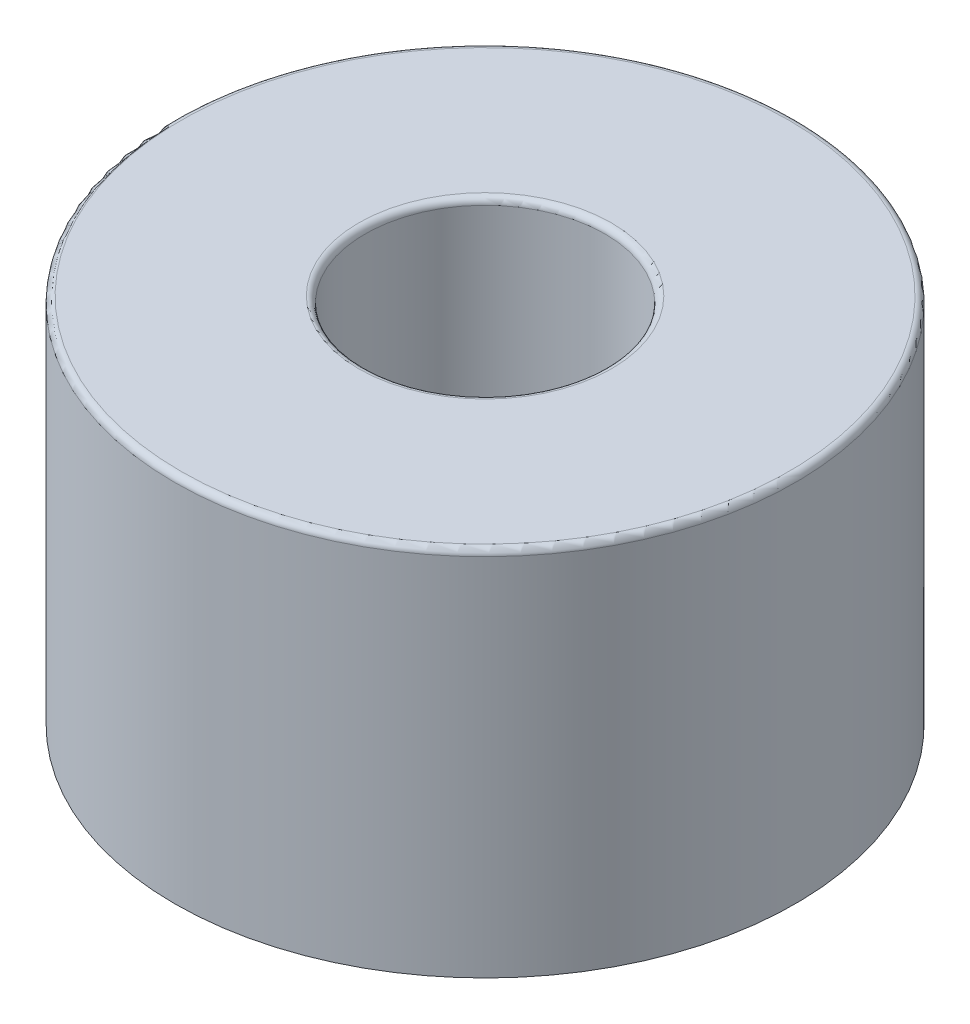
ISO-10303-21;
HEADER;
FILE_DESCRIPTION(('STEP AP214'),'2;1');
FILE_NAME('part.step','',(''),(''),'','','');
FILE_SCHEMA(('AUTOMOTIVE_DESIGN { 1 0 10303 214 1 1 1 1 }'));
ENDSEC;
DATA;
#1=APPLICATION_CONTEXT('core data for automotive mechanical design processes');
#2=APPLICATION_PROTOCOL_DEFINITION('international standard','automotive_design',2000,#1);
#3=PRODUCT_CONTEXT('',#1,'mechanical');
#4=PRODUCT('Part','Part','',(#3));
#5=PRODUCT_RELATED_PRODUCT_CATEGORY('part','',(#4));
#6=PRODUCT_DEFINITION_FORMATION('','',#4);
#7=PRODUCT_DEFINITION_CONTEXT('part definition',#1,'design');
#8=PRODUCT_DEFINITION('design','',#6,#7);
#9=PRODUCT_DEFINITION_SHAPE('','',#8);
#10=(LENGTH_UNIT() NAMED_UNIT(*) SI_UNIT(.MILLI.,.METRE.));
#11=(NAMED_UNIT(*) PLANE_ANGLE_UNIT() SI_UNIT($,.RADIAN.));
#12=(NAMED_UNIT(*) SI_UNIT($,.STERADIAN.) SOLID_ANGLE_UNIT());
#13=UNCERTAINTY_MEASURE_WITH_UNIT(LENGTH_MEASURE(1.E-05),#10,'distance_accuracy_value','');
#14=(GEOMETRIC_REPRESENTATION_CONTEXT(3) GLOBAL_UNCERTAINTY_ASSIGNED_CONTEXT((#13)) GLOBAL_UNIT_ASSIGNED_CONTEXT((#10,
#11,#12)) REPRESENTATION_CONTEXT('',''));
#15=CARTESIAN_POINT('',(0.,0.,0.));
#16=DIRECTION('',(0.,0.,1.));
#17=DIRECTION('',(1.,0.,0.));
#18=AXIS2_PLACEMENT_3D('',#15,#16,#17);
#19=CARTESIAN_POINT('',(0.,14.732,0.));
#20=DIRECTION('',(0.,1.,0.));
#21=DIRECTION('',(0.,0.,1.));
#22=AXIS2_PLACEMENT_3D('',#19,#20,#21);
#23=PLANE('',#22);
#24=CARTESIAN_POINT('',(0.,14.732,0.));
#25=DIRECTION('',(0.,1.,0.));
#26=DIRECTION('',(0.,0.,1.));
#27=AXIS2_PLACEMENT_3D('',#24,#25,#26);
#28=CIRCLE('',#27,5.0165);
#29=CARTESIAN_POINT('',(0.,14.732,5.0165));
#30=VERTEX_POINT('',#29);
#31=EDGE_CURVE('E37',#30,#30,#28,.F.);
#32=ORIENTED_EDGE('',*,*,#31,.T.);
#33=EDGE_LOOP('',(#32));
#34=FACE_BOUND('',#33,.T.);
#35=CARTESIAN_POINT('',(0.,14.732,0.));
#36=DIRECTION('',(0.,1.,0.));
#37=DIRECTION('',(0.,0.,1.));
#38=AXIS2_PLACEMENT_3D('',#35,#36,#37);
#39=CIRCLE('',#38,12.065);
#40=CARTESIAN_POINT('',(0.,14.732,12.065));
#41=VERTEX_POINT('',#40);
#42=EDGE_CURVE('E41',#41,#41,#39,.T.);
#43=ORIENTED_EDGE('',*,*,#42,.T.);
#44=EDGE_LOOP('',(#43));
#45=FACE_BOUND('',#44,.T.);
#46=ADVANCED_FACE('F30',(#34,#45),#23,.T.);
#47=CARTESIAN_POINT('',(0.,0.,0.));
#48=DIRECTION('',(0.,1.,0.));
#49=DIRECTION('',(0.,0.,1.));
#50=AXIS2_PLACEMENT_3D('',#47,#48,#49);
#51=PLANE('',#50);
#52=CARTESIAN_POINT('',(0.,0.,0.));
#53=DIRECTION('',(0.,1.,0.));
#54=DIRECTION('',(0.,0.,1.));
#55=AXIS2_PLACEMENT_3D('',#52,#53,#54);
#56=CIRCLE('',#55,12.319);
#57=CARTESIAN_POINT('',(0.,0.,12.319));
#58=VERTEX_POINT('',#57);
#59=EDGE_CURVE('E50',#58,#58,#56,.T.);
#60=ORIENTED_EDGE('',*,*,#59,.F.);
#61=EDGE_LOOP('',(#60));
#62=FACE_BOUND('',#61,.T.);
#63=CARTESIAN_POINT('',(0.,0.,0.));
#64=DIRECTION('',(0.,1.,0.));
#65=DIRECTION('',(0.,0.,1.));
#66=AXIS2_PLACEMENT_3D('',#63,#64,#65);
#67=CIRCLE('',#66,4.7625);
#68=CARTESIAN_POINT('',(0.,0.,4.7625));
#69=VERTEX_POINT('',#68);
#70=EDGE_CURVE('E53',#69,#69,#67,.T.);
#71=ORIENTED_EDGE('',*,*,#70,.T.);
#72=EDGE_LOOP('',(#71));
#73=FACE_BOUND('',#72,.T.);
#74=ADVANCED_FACE('F57',(#62,#73),#51,.F.);
#75=CARTESIAN_POINT('',(0.,14.732,0.));
#76=DIRECTION('',(0.,-1.,0.));
#77=DIRECTION('',(0.,0.,-1.));
#78=AXIS2_PLACEMENT_3D('',#75,#76,#77);
#79=CYLINDRICAL_SURFACE('',#78,12.319);
#80=CARTESIAN_POINT('',(0.,14.478,0.));
#81=DIRECTION('',(0.,1.,0.));
#82=DIRECTION('',(0.,0.,1.));
#83=AXIS2_PLACEMENT_3D('',#80,#81,#82);
#84=CIRCLE('',#83,12.319);
#85=CARTESIAN_POINT('',(0.,14.478,12.319));
#86=VERTEX_POINT('',#85);
#87=EDGE_CURVE('E10',#86,#86,#84,.F.);
#88=ORIENTED_EDGE('',*,*,#87,.T.);
#89=EDGE_LOOP('',(#88));
#90=FACE_BOUND('',#89,.T.);
#91=ORIENTED_EDGE('',*,*,#59,.T.);
#92=EDGE_LOOP('',(#91));
#93=FACE_BOUND('',#92,.T.);
#94=ADVANCED_FACE('F62',(#90,#93),#79,.T.);
#95=CARTESIAN_POINT('',(0.,14.732,0.));
#96=DIRECTION('',(0.,-1.,0.));
#97=DIRECTION('',(0.,0.,-1.));
#98=AXIS2_PLACEMENT_3D('',#95,#96,#97);
#99=CYLINDRICAL_SURFACE('',#98,4.7625);
#100=CARTESIAN_POINT('',(0.,14.478,0.));
#101=DIRECTION('',(0.,1.,0.));
#102=DIRECTION('',(0.,0.,1.));
#103=AXIS2_PLACEMENT_3D('',#100,#101,#102);
#104=CIRCLE('',#103,4.7625);
#105=CARTESIAN_POINT('',(0.,14.478,4.7625));
#106=VERTEX_POINT('',#105);
#107=EDGE_CURVE('E45',#106,#106,#104,.T.);
#108=ORIENTED_EDGE('',*,*,#107,.T.);
#109=EDGE_LOOP('',(#108));
#110=FACE_BOUND('',#109,.T.);
#111=ORIENTED_EDGE('',*,*,#70,.F.);
#112=EDGE_LOOP('',(#111));
#113=FACE_BOUND('',#112,.T.);
#114=ADVANCED_FACE('F59',(#110,#113),#99,.F.);
#115=CARTESIAN_POINT('',(0.,14.478,0.));
#116=DIRECTION('',(0.,1.,0.));
#117=DIRECTION('',(0.,0.,1.));
#118=AXIS2_PLACEMENT_3D('',#115,#116,#117);
#119=TOROIDAL_SURFACE('',#118,5.0165,0.254);
#120=ORIENTED_EDGE('',*,*,#31,.F.);
#121=EDGE_LOOP('',(#120));
#122=FACE_BOUND('',#121,.T.);
#123=ORIENTED_EDGE('',*,*,#107,.F.);
#124=EDGE_LOOP('',(#123));
#125=FACE_BOUND('',#124,.T.);
#126=ADVANCED_FACE('F61',(#122,#125),#119,.T.);
#127=CARTESIAN_POINT('',(0.,14.478,0.));
#128=DIRECTION('',(0.,1.,0.));
#129=DIRECTION('',(0.,0.,1.));
#130=AXIS2_PLACEMENT_3D('',#127,#128,#129);
#131=TOROIDAL_SURFACE('',#130,12.065,0.254);
#132=ORIENTED_EDGE('',*,*,#87,.F.);
#133=EDGE_LOOP('',(#132));
#134=FACE_BOUND('',#133,.T.);
#135=ORIENTED_EDGE('',*,*,#42,.F.);
#136=EDGE_LOOP('',(#135));
#137=FACE_BOUND('',#136,.T.);
#138=ADVANCED_FACE('F32',(#134,#137),#131,.T.);
#139=CLOSED_SHELL('',(#46,#74,#94,#114,#126,#138));
#140=MANIFOLD_SOLID_BREP('B2',#139);
#141=ADVANCED_BREP_SHAPE_REPRESENTATION('',(#18,#140),#14);
#142=SHAPE_DEFINITION_REPRESENTATION(#9,#141);
ENDSEC;
END-ISO-10303-21;
